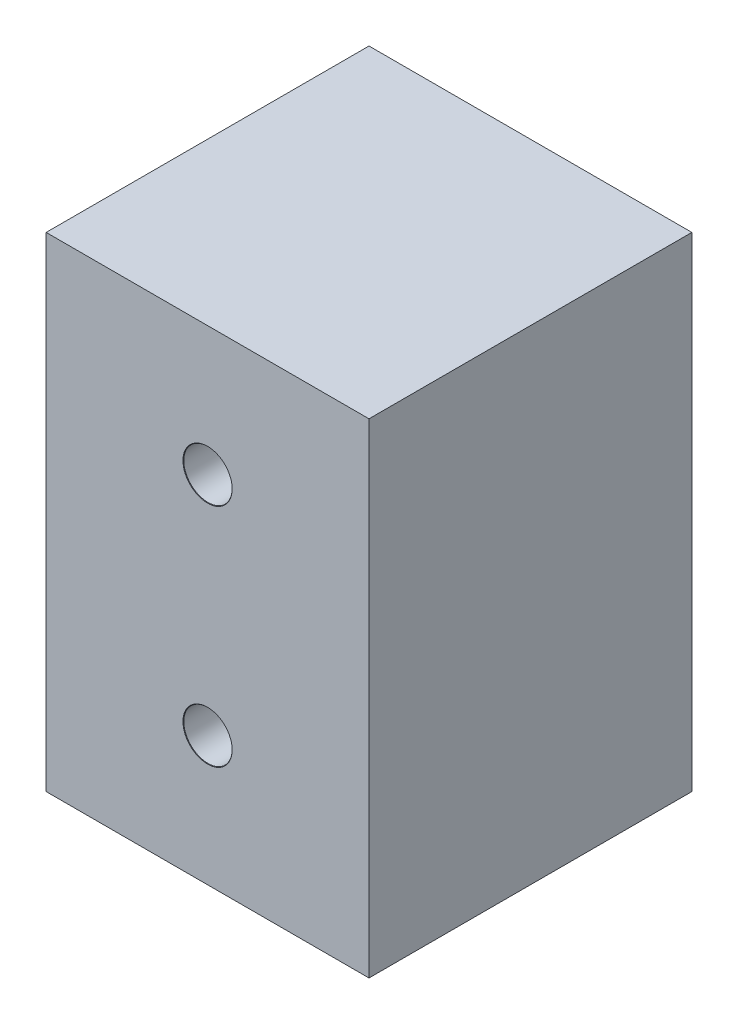
ISO-10303-21;
HEADER;
FILE_DESCRIPTION(('STEP AP214'),'2;1');
FILE_NAME('part.step','',(''),(''),'','','');
FILE_SCHEMA(('AUTOMOTIVE_DESIGN { 1 0 10303 214 1 1 1 1 }'));
ENDSEC;
DATA;
#1=APPLICATION_CONTEXT('core data for automotive mechanical design processes');
#2=APPLICATION_PROTOCOL_DEFINITION('international standard','automotive_design',2000,#1);
#3=PRODUCT_CONTEXT('',#1,'mechanical');
#4=PRODUCT('Part','Part','',(#3));
#5=PRODUCT_RELATED_PRODUCT_CATEGORY('part','',(#4));
#6=PRODUCT_DEFINITION_FORMATION('','',#4);
#7=PRODUCT_DEFINITION_CONTEXT('part definition',#1,'design');
#8=PRODUCT_DEFINITION('design','',#6,#7);
#9=PRODUCT_DEFINITION_SHAPE('','',#8);
#10=(LENGTH_UNIT() NAMED_UNIT(*) SI_UNIT(.MILLI.,.METRE.));
#11=(NAMED_UNIT(*) PLANE_ANGLE_UNIT() SI_UNIT($,.RADIAN.));
#12=(NAMED_UNIT(*) SI_UNIT($,.STERADIAN.) SOLID_ANGLE_UNIT());
#13=UNCERTAINTY_MEASURE_WITH_UNIT(LENGTH_MEASURE(1.E-05),#10,'distance_accuracy_value','');
#14=(GEOMETRIC_REPRESENTATION_CONTEXT(3) GLOBAL_UNCERTAINTY_ASSIGNED_CONTEXT((#13)) GLOBAL_UNIT_ASSIGNED_CONTEXT((#10,
#11,#12)) REPRESENTATION_CONTEXT('',''));
#15=CARTESIAN_POINT('',(0.,0.,0.));
#16=DIRECTION('',(0.,0.,1.));
#17=DIRECTION('',(1.,0.,0.));
#18=AXIS2_PLACEMENT_3D('',#15,#16,#17);
#19=CARTESIAN_POINT('',(0.,30.,0.));
#20=DIRECTION('',(1.,0.,0.));
#21=DIRECTION('',(0.,0.,-1.));
#22=AXIS2_PLACEMENT_3D('',#19,#20,#21);
#23=PLANE('',#22);
#24=DIRECTION('',(0.,0.,1.));
#25=VECTOR('',#24,1.);
#26=CARTESIAN_POINT('',(0.,0.,0.));
#27=LINE('',#26,#25);
#28=CARTESIAN_POINT('',(0.,0.,0.));
#29=VERTEX_POINT('',#28);
#30=CARTESIAN_POINT('',(0.,0.,20.));
#31=VERTEX_POINT('',#30);
#32=EDGE_CURVE('E96',#29,#31,#27,.T.);
#33=ORIENTED_EDGE('',*,*,#32,.T.);
#34=DIRECTION('',(0.,-1.,0.));
#35=VECTOR('',#34,1.);
#36=CARTESIAN_POINT('',(0.,30.,20.));
#37=LINE('',#36,#35);
#38=CARTESIAN_POINT('',(0.,30.,20.));
#39=VERTEX_POINT('',#38);
#40=EDGE_CURVE('E11',#39,#31,#37,.T.);
#41=ORIENTED_EDGE('',*,*,#40,.F.);
#42=DIRECTION('',(0.,0.,1.));
#43=VECTOR('',#42,1.);
#44=CARTESIAN_POINT('',(0.,30.,0.));
#45=LINE('',#44,#43);
#46=CARTESIAN_POINT('',(0.,30.,0.));
#47=VERTEX_POINT('',#46);
#48=EDGE_CURVE('E84',#47,#39,#45,.T.);
#49=ORIENTED_EDGE('',*,*,#48,.F.);
#50=DIRECTION('',(0.,-1.,0.));
#51=VECTOR('',#50,1.);
#52=CARTESIAN_POINT('',(0.,30.,0.));
#53=LINE('',#52,#51);
#54=EDGE_CURVE('E92',#47,#29,#53,.T.);
#55=ORIENTED_EDGE('',*,*,#54,.T.);
#56=EDGE_LOOP('',(#33,#41,#49,#55));
#57=FACE_BOUND('',#56,.T.);
#58=ADVANCED_FACE('F33',(#57),#23,.F.);
#59=CARTESIAN_POINT('',(0.,30.,20.));
#60=DIRECTION('',(0.,0.,-1.));
#61=DIRECTION('',(-1.,0.,0.));
#62=AXIS2_PLACEMENT_3D('',#59,#60,#61);
#63=PLANE('',#62);
#64=CARTESIAN_POINT('',(10.,22.,20.));
#65=DIRECTION('',(0.,0.,1.));
#66=DIRECTION('',(1.,0.,0.));
#67=AXIS2_PLACEMENT_3D('',#64,#65,#66);
#68=CIRCLE('',#67,1.525);
#69=CARTESIAN_POINT('',(11.525,22.,20.));
#70=VERTEX_POINT('',#69);
#71=EDGE_CURVE('E124',#70,#70,#68,.T.);
#72=ORIENTED_EDGE('',*,*,#71,.F.);
#73=EDGE_LOOP('',(#72));
#74=FACE_BOUND('',#73,.T.);
#75=CARTESIAN_POINT('',(10.,8.,20.));
#76=DIRECTION('',(0.,0.,1.));
#77=DIRECTION('',(1.,0.,0.));
#78=AXIS2_PLACEMENT_3D('',#75,#76,#77);
#79=CIRCLE('',#78,1.525);
#80=CARTESIAN_POINT('',(11.525,8.,20.));
#81=VERTEX_POINT('',#80);
#82=EDGE_CURVE('E115',#81,#81,#79,.T.);
#83=ORIENTED_EDGE('',*,*,#82,.F.);
#84=EDGE_LOOP('',(#83));
#85=FACE_BOUND('',#84,.T.);
#86=DIRECTION('',(1.,0.,0.));
#87=VECTOR('',#86,1.);
#88=CARTESIAN_POINT('',(0.,0.,20.));
#89=LINE('',#88,#87);
#90=CARTESIAN_POINT('',(20.,0.,20.));
#91=VERTEX_POINT('',#90);
#92=EDGE_CURVE('E88',#31,#91,#89,.T.);
#93=ORIENTED_EDGE('',*,*,#92,.T.);
#94=DIRECTION('',(0.,-1.,0.));
#95=VECTOR('',#94,1.);
#96=CARTESIAN_POINT('',(20.,30.,20.));
#97=LINE('',#96,#95);
#98=CARTESIAN_POINT('',(20.,30.,20.));
#99=VERTEX_POINT('',#98);
#100=EDGE_CURVE('E41',#99,#91,#97,.T.);
#101=ORIENTED_EDGE('',*,*,#100,.F.);
#102=DIRECTION('',(1.,0.,0.));
#103=VECTOR('',#102,1.);
#104=CARTESIAN_POINT('',(0.,30.,20.));
#105=LINE('',#104,#103);
#106=EDGE_CURVE('E79',#39,#99,#105,.T.);
#107=ORIENTED_EDGE('',*,*,#106,.F.);
#108=ORIENTED_EDGE('',*,*,#40,.T.);
#109=EDGE_LOOP('',(#93,#101,#107,#108));
#110=FACE_BOUND('',#109,.T.);
#111=ADVANCED_FACE('F87',(#74,#85,#110),#63,.F.);
#112=CARTESIAN_POINT('',(20.,30.,0.));
#113=DIRECTION('',(-1.,0.,0.));
#114=DIRECTION('',(0.,0.,1.));
#115=AXIS2_PLACEMENT_3D('',#112,#113,#114);
#116=PLANE('',#115);
#117=DIRECTION('',(0.,0.,-1.));
#118=VECTOR('',#117,1.);
#119=CARTESIAN_POINT('',(20.,0.,0.));
#120=LINE('',#119,#118);
#121=CARTESIAN_POINT('',(20.,0.,0.));
#122=VERTEX_POINT('',#121);
#123=EDGE_CURVE('E66',#91,#122,#120,.T.);
#124=ORIENTED_EDGE('',*,*,#123,.T.);
#125=DIRECTION('',(0.,-1.,0.));
#126=VECTOR('',#125,1.);
#127=CARTESIAN_POINT('',(20.,30.,0.));
#128=LINE('',#127,#126);
#129=CARTESIAN_POINT('',(20.,30.,0.));
#130=VERTEX_POINT('',#129);
#131=EDGE_CURVE('E89',#130,#122,#128,.T.);
#132=ORIENTED_EDGE('',*,*,#131,.F.);
#133=DIRECTION('',(0.,0.,-1.));
#134=VECTOR('',#133,1.);
#135=CARTESIAN_POINT('',(20.,30.,0.));
#136=LINE('',#135,#134);
#137=EDGE_CURVE('E82',#99,#130,#136,.T.);
#138=ORIENTED_EDGE('',*,*,#137,.F.);
#139=ORIENTED_EDGE('',*,*,#100,.T.);
#140=EDGE_LOOP('',(#124,#132,#138,#139));
#141=FACE_BOUND('',#140,.T.);
#142=ADVANCED_FACE('F90',(#141),#116,.F.);
#143=CARTESIAN_POINT('',(0.,30.,0.));
#144=DIRECTION('',(0.,0.,1.));
#145=DIRECTION('',(1.,0.,0.));
#146=AXIS2_PLACEMENT_3D('',#143,#144,#145);
#147=PLANE('',#146);
#148=CARTESIAN_POINT('',(10.,22.,0.));
#149=DIRECTION('',(0.,0.,1.));
#150=DIRECTION('',(1.,0.,0.));
#151=AXIS2_PLACEMENT_3D('',#148,#149,#150);
#152=CIRCLE('',#151,1.49999999999999);
#153=CARTESIAN_POINT('',(11.5,22.,0.));
#154=VERTEX_POINT('',#153);
#155=EDGE_CURVE('E118',#154,#154,#152,.T.);
#156=ORIENTED_EDGE('',*,*,#155,.T.);
#157=EDGE_LOOP('',(#156));
#158=FACE_BOUND('',#157,.T.);
#159=CARTESIAN_POINT('',(10.,8.,0.));
#160=DIRECTION('',(0.,0.,1.));
#161=DIRECTION('',(1.,0.,0.));
#162=AXIS2_PLACEMENT_3D('',#159,#160,#161);
#163=CIRCLE('',#162,1.49999999999999);
#164=CARTESIAN_POINT('',(11.5,8.,0.));
#165=VERTEX_POINT('',#164);
#166=EDGE_CURVE('E99',#165,#165,#163,.T.);
#167=ORIENTED_EDGE('',*,*,#166,.T.);
#168=EDGE_LOOP('',(#167));
#169=FACE_BOUND('',#168,.T.);
#170=DIRECTION('',(-1.,0.,0.));
#171=VECTOR('',#170,1.);
#172=CARTESIAN_POINT('',(0.,0.,0.));
#173=LINE('',#172,#171);
#174=EDGE_CURVE('E72',#122,#29,#173,.T.);
#175=ORIENTED_EDGE('',*,*,#174,.T.);
#176=ORIENTED_EDGE('',*,*,#54,.F.);
#177=DIRECTION('',(-1.,0.,0.));
#178=VECTOR('',#177,1.);
#179=CARTESIAN_POINT('',(0.,30.,0.));
#180=LINE('',#179,#178);
#181=EDGE_CURVE('E49',#130,#47,#180,.T.);
#182=ORIENTED_EDGE('',*,*,#181,.F.);
#183=ORIENTED_EDGE('',*,*,#131,.T.);
#184=EDGE_LOOP('',(#175,#176,#182,#183));
#185=FACE_BOUND('',#184,.T.);
#186=ADVANCED_FACE('F104',(#158,#169,#185),#147,.F.);
#187=CARTESIAN_POINT('',(0.,30.,0.));
#188=DIRECTION('',(0.,1.,0.));
#189=DIRECTION('',(0.,0.,1.));
#190=AXIS2_PLACEMENT_3D('',#187,#188,#189);
#191=PLANE('',#190);
#192=ORIENTED_EDGE('',*,*,#48,.T.);
#193=ORIENTED_EDGE('',*,*,#106,.T.);
#194=ORIENTED_EDGE('',*,*,#137,.T.);
#195=ORIENTED_EDGE('',*,*,#181,.T.);
#196=EDGE_LOOP('',(#192,#193,#194,#195));
#197=FACE_BOUND('',#196,.T.);
#198=ADVANCED_FACE('F80',(#197),#191,.T.);
#199=CARTESIAN_POINT('',(0.,0.,0.));
#200=DIRECTION('',(0.,1.,0.));
#201=DIRECTION('',(0.,0.,1.));
#202=AXIS2_PLACEMENT_3D('',#199,#200,#201);
#203=PLANE('',#202);
#204=ORIENTED_EDGE('',*,*,#32,.F.);
#205=ORIENTED_EDGE('',*,*,#174,.F.);
#206=ORIENTED_EDGE('',*,*,#123,.F.);
#207=ORIENTED_EDGE('',*,*,#92,.F.);
#208=EDGE_LOOP('',(#204,#205,#206,#207));
#209=FACE_BOUND('',#208,.T.);
#210=ADVANCED_FACE('F107',(#209),#203,.F.);
#211=CARTESIAN_POINT('',(10.,8.,20.));
#212=DIRECTION('',(0.,0.,1.));
#213=DIRECTION('',(1.,0.,0.));
#214=AXIS2_PLACEMENT_3D('',#211,#212,#213);
#215=CYLINDRICAL_SURFACE('',#214,1.49999999999999);
#216=ORIENTED_EDGE('',*,*,#166,.F.);
#217=EDGE_LOOP('',(#216));
#218=FACE_BOUND('',#217,.T.);
#219=CARTESIAN_POINT('',(10.,8.,19.975));
#220=DIRECTION('',(0.,0.,1.));
#221=DIRECTION('',(1.,0.,0.));
#222=AXIS2_PLACEMENT_3D('',#219,#220,#221);
#223=CIRCLE('',#222,1.49999999999999);
#224=CARTESIAN_POINT('',(11.5,8.,19.975));
#225=VERTEX_POINT('',#224);
#226=EDGE_CURVE('E112',#225,#225,#223,.T.);
#227=ORIENTED_EDGE('',*,*,#226,.T.);
#228=EDGE_LOOP('',(#227));
#229=FACE_BOUND('',#228,.T.);
#230=ADVANCED_FACE('F137',(#218,#229),#215,.F.);
#231=CARTESIAN_POINT('',(10.,8.,20.));
#232=DIRECTION('',(0.,0.,1.));
#233=DIRECTION('',(1.,0.,0.));
#234=AXIS2_PLACEMENT_3D('',#231,#232,#233);
#235=CONICAL_SURFACE('',#234,1.525,0.785398163397379);
#236=ORIENTED_EDGE('',*,*,#226,.F.);
#237=EDGE_LOOP('',(#236));
#238=FACE_BOUND('',#237,.T.);
#239=ORIENTED_EDGE('',*,*,#82,.T.);
#240=EDGE_LOOP('',(#239));
#241=FACE_BOUND('',#240,.T.);
#242=ADVANCED_FACE('F134',(#238,#241),#235,.F.);
#243=CARTESIAN_POINT('',(10.,22.,20.));
#244=DIRECTION('',(0.,0.,1.));
#245=DIRECTION('',(1.,0.,0.));
#246=AXIS2_PLACEMENT_3D('',#243,#244,#245);
#247=CYLINDRICAL_SURFACE('',#246,1.49999999999999);
#248=ORIENTED_EDGE('',*,*,#155,.F.);
#249=EDGE_LOOP('',(#248));
#250=FACE_BOUND('',#249,.T.);
#251=CARTESIAN_POINT('',(10.,22.,19.975));
#252=DIRECTION('',(0.,0.,1.));
#253=DIRECTION('',(1.,0.,0.));
#254=AXIS2_PLACEMENT_3D('',#251,#252,#253);
#255=CIRCLE('',#254,1.49999999999999);
#256=CARTESIAN_POINT('',(11.5,22.,19.975));
#257=VERTEX_POINT('',#256);
#258=EDGE_CURVE('E121',#257,#257,#255,.T.);
#259=ORIENTED_EDGE('',*,*,#258,.T.);
#260=EDGE_LOOP('',(#259));
#261=FACE_BOUND('',#260,.T.);
#262=ADVANCED_FACE('F136',(#250,#261),#247,.F.);
#263=CARTESIAN_POINT('',(10.,22.,20.));
#264=DIRECTION('',(0.,0.,1.));
#265=DIRECTION('',(1.,0.,0.));
#266=AXIS2_PLACEMENT_3D('',#263,#264,#265);
#267=CONICAL_SURFACE('',#266,1.525,0.785398163397379);
#268=ORIENTED_EDGE('',*,*,#258,.F.);
#269=EDGE_LOOP('',(#268));
#270=FACE_BOUND('',#269,.T.);
#271=ORIENTED_EDGE('',*,*,#71,.T.);
#272=EDGE_LOOP('',(#271));
#273=FACE_BOUND('',#272,.T.);
#274=ADVANCED_FACE('F128',(#270,#273),#267,.F.);
#275=CLOSED_SHELL('',(#58,#111,#142,#186,#198,#210,#230,#242,#262,#274));
#276=MANIFOLD_SOLID_BREP('B2',#275);
#277=ADVANCED_BREP_SHAPE_REPRESENTATION('',(#18,#276),#14);
#278=SHAPE_DEFINITION_REPRESENTATION(#9,#277);
ENDSEC;
END-ISO-10303-21;
